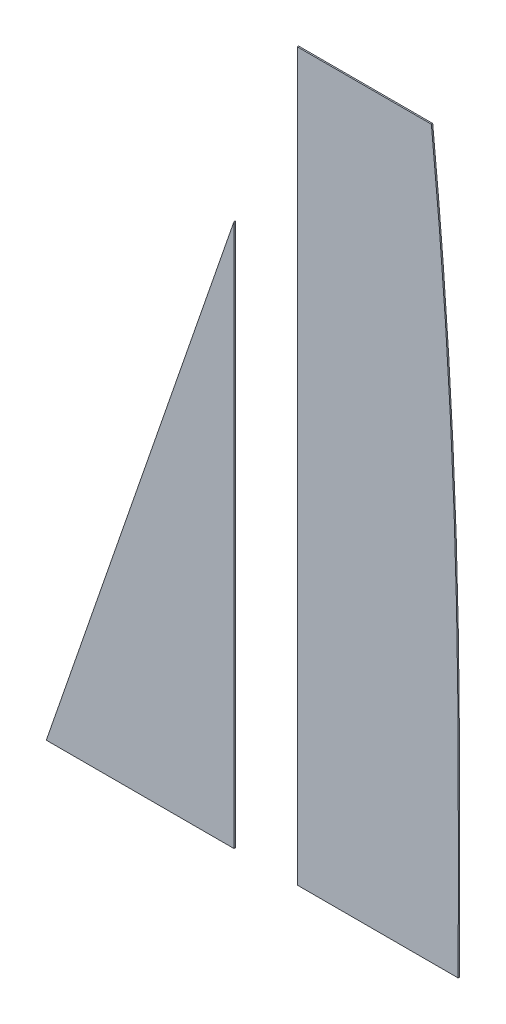
ISO-10303-21;
HEADER;
FILE_DESCRIPTION(('STEP AP214'),'2;1');
FILE_NAME('part.step','',(''),(''),'','','');
FILE_SCHEMA(('AUTOMOTIVE_DESIGN { 1 0 10303 214 1 1 1 1 }'));
ENDSEC;
DATA;
#1=APPLICATION_CONTEXT('core data for automotive mechanical design processes');
#2=APPLICATION_PROTOCOL_DEFINITION('international standard','automotive_design',2000,#1);
#3=PRODUCT_CONTEXT('',#1,'mechanical');
#4=PRODUCT('Part','Part','',(#3));
#5=PRODUCT_RELATED_PRODUCT_CATEGORY('part','',(#4));
#6=PRODUCT_DEFINITION_FORMATION('','',#4);
#7=PRODUCT_DEFINITION_CONTEXT('part definition',#1,'design');
#8=PRODUCT_DEFINITION('design','',#6,#7);
#9=PRODUCT_DEFINITION_SHAPE('','',#8);
#10=(LENGTH_UNIT() NAMED_UNIT(*) SI_UNIT(.MILLI.,.METRE.));
#11=(NAMED_UNIT(*) PLANE_ANGLE_UNIT() SI_UNIT($,.RADIAN.));
#12=(NAMED_UNIT(*) SI_UNIT($,.STERADIAN.) SOLID_ANGLE_UNIT());
#13=UNCERTAINTY_MEASURE_WITH_UNIT(LENGTH_MEASURE(1.E-05),#10,'distance_accuracy_value','');
#14=(GEOMETRIC_REPRESENTATION_CONTEXT(3) GLOBAL_UNCERTAINTY_ASSIGNED_CONTEXT((#13)) GLOBAL_UNIT_ASSIGNED_CONTEXT((#10,
#11,#12)) REPRESENTATION_CONTEXT('',''));
#15=CARTESIAN_POINT('',(0.,0.,0.));
#16=DIRECTION('',(0.,0.,1.));
#17=DIRECTION('',(1.,0.,0.));
#18=AXIS2_PLACEMENT_3D('',#15,#16,#17);
#19=CARTESIAN_POINT('',(424.551491801619,2.1473979278791E-13,2.54));
#20=CARTESIAN_POINT('',(424.572856429708,401.777203165063,2.54));
#21=CARTESIAN_POINT('',(432.304675957835,795.435328410901,2.54));
#22=CARTESIAN_POINT('',(373.751491801636,1375.12395842616,2.54));
#23=B_SPLINE_CURVE_WITH_KNOTS('',3,(#19,#20,#21,#22),.UNSPECIFIED.,.F.,.F.,(4,4),(0.,1.),.UNSPECIFIED.);
#24=DIRECTION('',(0.,0.,-1.));
#25=VECTOR('',#24,1.);
#26=SURFACE_OF_LINEAR_EXTRUSION('',#23,#25);
#27=CARTESIAN_POINT('',(424.551491801619,2.1473979278791E-13,0.));
#28=CARTESIAN_POINT('',(424.572856429708,401.777203165063,0.));
#29=CARTESIAN_POINT('',(432.304675957835,795.435328410901,0.));
#30=CARTESIAN_POINT('',(373.751491801636,1375.12395842616,0.));
#31=B_SPLINE_CURVE_WITH_KNOTS('',3,(#27,#28,#29,#30),.UNSPECIFIED.,.F.,.F.,(4,4),(0.,1.),.UNSPECIFIED.);
#32=CARTESIAN_POINT('',(424.551491801619,0.,0.));
#33=VERTEX_POINT('',#32);
#34=CARTESIAN_POINT('',(373.751491801636,1375.12395842616,0.));
#35=VERTEX_POINT('',#34);
#36=EDGE_CURVE('E150',#33,#35,#31,.T.);
#37=ORIENTED_EDGE('',*,*,#36,.T.);
#38=DIRECTION('',(0.,0.,-1.));
#39=VECTOR('',#38,1.);
#40=CARTESIAN_POINT('',(373.751491801636,1375.12395842616,2.54));
#41=LINE('',#40,#39);
#42=CARTESIAN_POINT('',(373.751491801636,1375.12395842616,2.54));
#43=VERTEX_POINT('',#42);
#44=EDGE_CURVE('E12',#43,#35,#41,.T.);
#45=ORIENTED_EDGE('',*,*,#44,.F.);
#46=CARTESIAN_POINT('',(373.751491801636,1375.12395842616,2.54));
#47=CARTESIAN_POINT('',(432.304675957835,795.435328410901,2.54));
#48=CARTESIAN_POINT('',(424.572856429708,401.777203165063,2.54));
#49=CARTESIAN_POINT('',(424.551491801619,2.1473979278791E-13,2.54));
#50=B_SPLINE_CURVE_WITH_KNOTS('',3,(#46,#47,#48,#49),.UNSPECIFIED.,.F.,.F.,(4,4),(0.,1.),.UNSPECIFIED.);
#51=CARTESIAN_POINT('',(424.551491801619,0.,2.54));
#52=VERTEX_POINT('',#51);
#53=EDGE_CURVE('E98',#52,#43,#50,.F.);
#54=ORIENTED_EDGE('',*,*,#53,.F.);
#55=DIRECTION('',(0.,0.,-1.));
#56=VECTOR('',#55,1.);
#57=CARTESIAN_POINT('',(424.551491801619,0.,2.54));
#58=LINE('',#57,#56);
#59=EDGE_CURVE('E108',#52,#33,#58,.T.);
#60=ORIENTED_EDGE('',*,*,#59,.T.);
#61=EDGE_LOOP('',(#37,#45,#54,#60));
#62=FACE_BOUND('',#61,.T.);
#63=ADVANCED_FACE('F43',(#62),#26,.F.);
#64=CARTESIAN_POINT('',(373.751491801636,1375.12395842616,2.54));
#65=DIRECTION('',(0.,-1.,0.));
#66=DIRECTION('',(0.,0.,-1.));
#67=AXIS2_PLACEMENT_3D('',#64,#65,#66);
#68=PLANE('',#67);
#69=DIRECTION('',(-1.,0.,0.));
#70=VECTOR('',#69,1.);
#71=CARTESIAN_POINT('',(373.751491801636,1375.12395842616,0.));
#72=LINE('',#71,#70);
#73=CARTESIAN_POINT('',(119.751491801636,1375.12395842616,0.));
#74=VERTEX_POINT('',#73);
#75=EDGE_CURVE('E103',#35,#74,#72,.T.);
#76=ORIENTED_EDGE('',*,*,#75,.T.);
#77=DIRECTION('',(0.,0.,-1.));
#78=VECTOR('',#77,1.);
#79=CARTESIAN_POINT('',(119.751491801636,1375.12395842616,2.54));
#80=LINE('',#79,#78);
#81=CARTESIAN_POINT('',(119.751491801636,1375.12395842616,2.54));
#82=VERTEX_POINT('',#81);
#83=EDGE_CURVE('E54',#82,#74,#80,.T.);
#84=ORIENTED_EDGE('',*,*,#83,.F.);
#85=DIRECTION('',(-1.,0.,0.));
#86=VECTOR('',#85,1.);
#87=CARTESIAN_POINT('',(373.751491801636,1375.12395842616,2.54));
#88=LINE('',#87,#86);
#89=EDGE_CURVE('E93',#43,#82,#88,.T.);
#90=ORIENTED_EDGE('',*,*,#89,.F.);
#91=ORIENTED_EDGE('',*,*,#44,.T.);
#92=EDGE_LOOP('',(#76,#84,#90,#91));
#93=FACE_BOUND('',#92,.T.);
#94=ADVANCED_FACE('F102',(#93),#68,.F.);
#95=CARTESIAN_POINT('',(119.751491801636,1375.12395842616,2.54));
#96=DIRECTION('',(1.,0.,0.));
#97=DIRECTION('',(0.,1.,0.));
#98=AXIS2_PLACEMENT_3D('',#95,#96,#97);
#99=PLANE('',#98);
#100=DIRECTION('',(0.,-1.,0.));
#101=VECTOR('',#100,1.);
#102=CARTESIAN_POINT('',(119.751491801636,1375.12395842616,0.));
#103=LINE('',#102,#101);
#104=CARTESIAN_POINT('',(119.751491801636,0.,0.));
#105=VERTEX_POINT('',#104);
#106=EDGE_CURVE('E80',#74,#105,#103,.T.);
#107=ORIENTED_EDGE('',*,*,#106,.T.);
#108=DIRECTION('',(0.,0.,-1.));
#109=VECTOR('',#108,1.);
#110=CARTESIAN_POINT('',(119.751491801636,0.,2.54));
#111=LINE('',#110,#109);
#112=CARTESIAN_POINT('',(119.751491801636,0.,2.54));
#113=VERTEX_POINT('',#112);
#114=EDGE_CURVE('E104',#113,#105,#111,.T.);
#115=ORIENTED_EDGE('',*,*,#114,.F.);
#116=DIRECTION('',(0.,-1.,0.));
#117=VECTOR('',#116,1.);
#118=CARTESIAN_POINT('',(119.751491801636,1375.12395842616,2.54));
#119=LINE('',#118,#117);
#120=EDGE_CURVE('E96',#82,#113,#119,.T.);
#121=ORIENTED_EDGE('',*,*,#120,.F.);
#122=ORIENTED_EDGE('',*,*,#83,.T.);
#123=EDGE_LOOP('',(#107,#115,#121,#122));
#124=FACE_BOUND('',#123,.T.);
#125=ADVANCED_FACE('F106',(#124),#99,.F.);
#126=CARTESIAN_POINT('',(119.751491801636,0.,2.54));
#127=DIRECTION('',(0.,1.,0.));
#128=DIRECTION('',(0.,0.,1.));
#129=AXIS2_PLACEMENT_3D('',#126,#127,#128);
#130=PLANE('',#129);
#131=DIRECTION('',(1.,0.,0.));
#132=VECTOR('',#131,1.);
#133=CARTESIAN_POINT('',(119.751491801636,0.,0.));
#134=LINE('',#133,#132);
#135=EDGE_CURVE('E86',#105,#33,#134,.T.);
#136=ORIENTED_EDGE('',*,*,#135,.T.);
#137=ORIENTED_EDGE('',*,*,#59,.F.);
#138=DIRECTION('',(1.,0.,0.));
#139=VECTOR('',#138,1.);
#140=CARTESIAN_POINT('',(119.751491801636,0.,2.54));
#141=LINE('',#140,#139);
#142=EDGE_CURVE('E63',#113,#52,#141,.T.);
#143=ORIENTED_EDGE('',*,*,#142,.F.);
#144=ORIENTED_EDGE('',*,*,#114,.T.);
#145=EDGE_LOOP('',(#136,#137,#143,#144));
#146=FACE_BOUND('',#145,.T.);
#147=ADVANCED_FACE('F130',(#146),#130,.F.);
#148=CARTESIAN_POINT('',(421.116947595735,620.845194144257,2.54));
#149=DIRECTION('',(0.,0.,1.));
#150=DIRECTION('',(1.,0.,0.));
#151=AXIS2_PLACEMENT_3D('',#148,#149,#150);
#152=PLANE('',#151);
#153=ORIENTED_EDGE('',*,*,#53,.T.);
#154=ORIENTED_EDGE('',*,*,#89,.T.);
#155=ORIENTED_EDGE('',*,*,#120,.T.);
#156=ORIENTED_EDGE('',*,*,#142,.T.);
#157=EDGE_LOOP('',(#153,#154,#155,#156));
#158=FACE_BOUND('',#157,.T.);
#159=ADVANCED_FACE('F94',(#158),#152,.T.);
#160=CARTESIAN_POINT('',(421.116947595735,620.845194144257,0.));
#161=DIRECTION('',(0.,0.,1.));
#162=DIRECTION('',(1.,0.,0.));
#163=AXIS2_PLACEMENT_3D('',#160,#161,#162);
#164=PLANE('',#163);
#165=ORIENTED_EDGE('',*,*,#36,.F.);
#166=ORIENTED_EDGE('',*,*,#135,.F.);
#167=ORIENTED_EDGE('',*,*,#106,.F.);
#168=ORIENTED_EDGE('',*,*,#75,.F.);
#169=EDGE_LOOP('',(#165,#166,#167,#168));
#170=FACE_BOUND('',#169,.T.);
#171=ADVANCED_FACE('F129',(#170),#164,.F.);
#172=CLOSED_SHELL('',(#63,#94,#125,#147,#159,#171));
#173=MANIFOLD_SOLID_BREP('B2',#172);
#174=CARTESIAN_POINT('',(-355.6,0.,2.54));
#175=DIRECTION('',(0.,1.,0.));
#176=DIRECTION('',(0.,0.,1.));
#177=AXIS2_PLACEMENT_3D('',#174,#175,#176);
#178=PLANE('',#177);
#179=DIRECTION('',(1.,0.,0.));
#180=VECTOR('',#179,1.);
#181=CARTESIAN_POINT('',(-355.6,0.,0.));
#182=LINE('',#181,#180);
#183=CARTESIAN_POINT('',(-355.6,0.,0.));
#184=VERTEX_POINT('',#183);
#185=CARTESIAN_POINT('',(0.,0.,0.));
#186=VERTEX_POINT('',#185);
#187=EDGE_CURVE('E271',#184,#186,#182,.T.);
#188=ORIENTED_EDGE('',*,*,#187,.T.);
#189=DIRECTION('',(0.,0.,-1.));
#190=VECTOR('',#189,1.);
#191=CARTESIAN_POINT('',(0.,0.,2.54));
#192=LINE('',#191,#190);
#193=CARTESIAN_POINT('',(0.,0.,2.54));
#194=VERTEX_POINT('',#193);
#195=EDGE_CURVE('E41',#194,#186,#192,.T.);
#196=ORIENTED_EDGE('',*,*,#195,.F.);
#197=DIRECTION('',(1.,0.,0.));
#198=VECTOR('',#197,1.);
#199=CARTESIAN_POINT('',(-355.6,0.,2.54));
#200=LINE('',#199,#198);
#201=CARTESIAN_POINT('',(-355.6,0.,2.54));
#202=VERTEX_POINT('',#201);
#203=EDGE_CURVE('E264',#202,#194,#200,.T.);
#204=ORIENTED_EDGE('',*,*,#203,.F.);
#205=DIRECTION('',(0.,0.,-1.));
#206=VECTOR('',#205,1.);
#207=CARTESIAN_POINT('',(-355.6,0.,2.54));
#208=LINE('',#207,#206);
#209=EDGE_CURVE('E272',#202,#184,#208,.T.);
#210=ORIENTED_EDGE('',*,*,#209,.T.);
#211=EDGE_LOOP('',(#188,#196,#204,#210));
#212=FACE_BOUND('',#211,.T.);
#213=ADVANCED_FACE('F224',(#212),#178,.F.);
#214=CARTESIAN_POINT('',(0.,0.,2.54));
#215=DIRECTION('',(-1.,0.,0.));
#216=DIRECTION('',(0.,0.,1.));
#217=AXIS2_PLACEMENT_3D('',#214,#215,#216);
#218=PLANE('',#217);
#219=DIRECTION('',(0.,1.,0.));
#220=VECTOR('',#219,1.);
#221=CARTESIAN_POINT('',(0.,0.,0.));
#222=LINE('',#221,#220);
#223=CARTESIAN_POINT('',(0.,1028.7,0.));
#224=VERTEX_POINT('',#223);
#225=EDGE_CURVE('E252',#186,#224,#222,.T.);
#226=ORIENTED_EDGE('',*,*,#225,.T.);
#227=DIRECTION('',(0.,0.,-1.));
#228=VECTOR('',#227,1.);
#229=CARTESIAN_POINT('',(0.,1028.7,2.54));
#230=LINE('',#229,#228);
#231=CARTESIAN_POINT('',(0.,1028.7,2.54));
#232=VERTEX_POINT('',#231);
#233=EDGE_CURVE('E232',#232,#224,#230,.T.);
#234=ORIENTED_EDGE('',*,*,#233,.F.);
#235=DIRECTION('',(0.,1.,0.));
#236=VECTOR('',#235,1.);
#237=CARTESIAN_POINT('',(0.,0.,2.54));
#238=LINE('',#237,#236);
#239=EDGE_CURVE('E260',#194,#232,#238,.T.);
#240=ORIENTED_EDGE('',*,*,#239,.F.);
#241=ORIENTED_EDGE('',*,*,#195,.T.);
#242=EDGE_LOOP('',(#226,#234,#240,#241));
#243=FACE_BOUND('',#242,.T.);
#244=ADVANCED_FACE('F261',(#243),#218,.F.);
#245=CARTESIAN_POINT('',(0.,1028.7,2.54));
#246=DIRECTION('',(0.945124712183162,-0.32670977705097,0.));
#247=DIRECTION('',(0.32670977705097,0.945124712183163,0.));
#248=AXIS2_PLACEMENT_3D('',#245,#246,#247);
#249=PLANE('',#248);
#250=DIRECTION('',(-0.32670977705097,-0.945124712183162,0.));
#251=VECTOR('',#250,1.);
#252=CARTESIAN_POINT('',(0.,1028.7,0.));
#253=LINE('',#252,#251);
#254=EDGE_CURVE('E257',#224,#184,#253,.T.);
#255=ORIENTED_EDGE('',*,*,#254,.T.);
#256=ORIENTED_EDGE('',*,*,#209,.F.);
#257=DIRECTION('',(-0.32670977705097,-0.945124712183162,0.));
#258=VECTOR('',#257,1.);
#259=CARTESIAN_POINT('',(0.,1028.7,2.54));
#260=LINE('',#259,#258);
#261=EDGE_CURVE('E240',#232,#202,#260,.T.);
#262=ORIENTED_EDGE('',*,*,#261,.F.);
#263=ORIENTED_EDGE('',*,*,#233,.T.);
#264=EDGE_LOOP('',(#255,#256,#262,#263));
#265=FACE_BOUND('',#264,.T.);
#266=ADVANCED_FACE('F279',(#265),#249,.F.);
#267=CARTESIAN_POINT('',(0.,0.,2.54));
#268=DIRECTION('',(0.,0.,1.));
#269=DIRECTION('',(1.,0.,0.));
#270=AXIS2_PLACEMENT_3D('',#267,#268,#269);
#271=PLANE('',#270);
#272=ORIENTED_EDGE('',*,*,#203,.T.);
#273=ORIENTED_EDGE('',*,*,#239,.T.);
#274=ORIENTED_EDGE('',*,*,#261,.T.);
#275=EDGE_LOOP('',(#272,#273,#274));
#276=FACE_BOUND('',#275,.T.);
#277=ADVANCED_FACE('F267',(#276),#271,.T.);
#278=CARTESIAN_POINT('',(0.,0.,0.));
#279=DIRECTION('',(0.,0.,1.));
#280=DIRECTION('',(1.,0.,0.));
#281=AXIS2_PLACEMENT_3D('',#278,#279,#280);
#282=PLANE('',#281);
#283=ORIENTED_EDGE('',*,*,#187,.F.);
#284=ORIENTED_EDGE('',*,*,#254,.F.);
#285=ORIENTED_EDGE('',*,*,#225,.F.);
#286=EDGE_LOOP('',(#283,#284,#285));
#287=FACE_BOUND('',#286,.T.);
#288=ADVANCED_FACE('F280',(#287),#282,.F.);
#289=CLOSED_SHELL('',(#213,#244,#266,#277,#288));
#290=MANIFOLD_SOLID_BREP('B6',#289);
#291=ADVANCED_BREP_SHAPE_REPRESENTATION('',(#18,#173,#290),#14);
#292=SHAPE_DEFINITION_REPRESENTATION(#9,#291);
ENDSEC;
END-ISO-10303-21;
